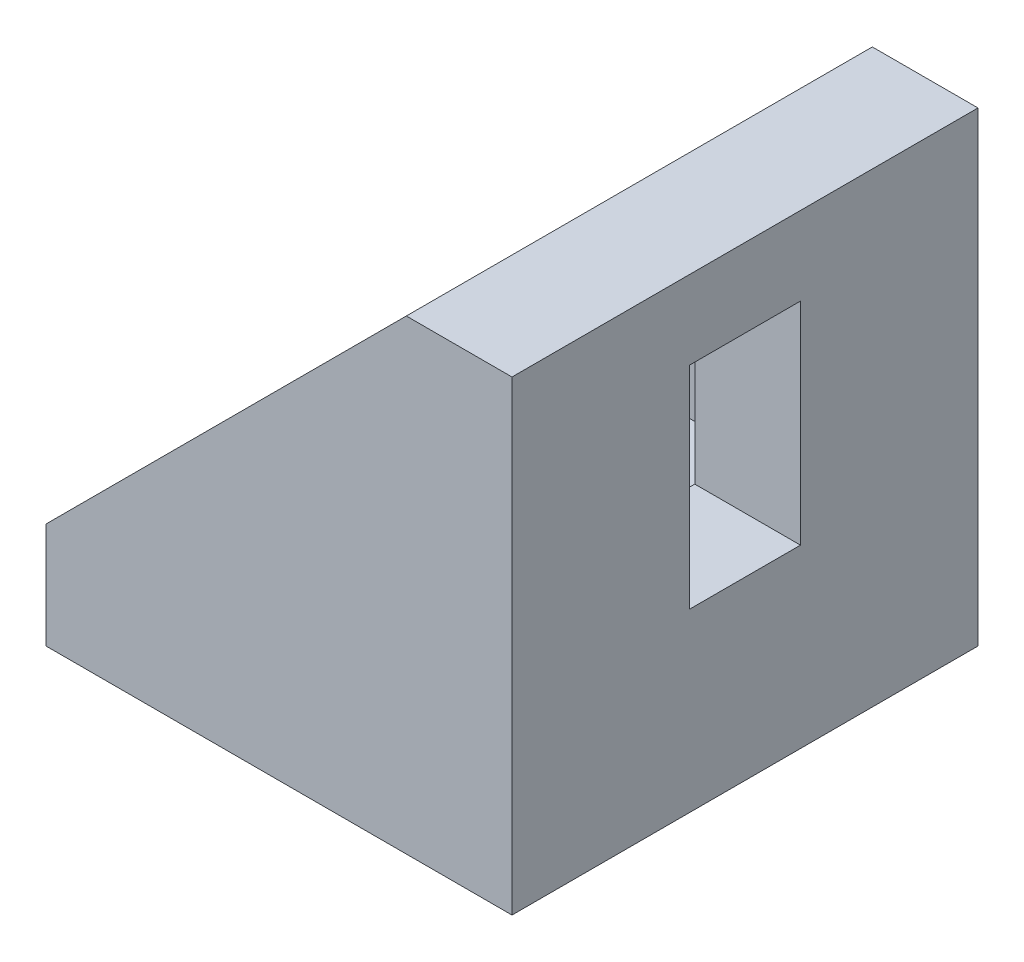
ISO-10303-21;
HEADER;
FILE_DESCRIPTION(('STEP AP214'),'2;1');
FILE_NAME('part.step','',(''),(''),'','','');
FILE_SCHEMA(('AUTOMOTIVE_DESIGN { 1 0 10303 214 1 1 1 1 }'));
ENDSEC;
DATA;
#1=APPLICATION_CONTEXT('core data for automotive mechanical design processes');
#2=APPLICATION_PROTOCOL_DEFINITION('international standard','automotive_design',2000,#1);
#3=PRODUCT_CONTEXT('',#1,'mechanical');
#4=PRODUCT('Part','Part','',(#3));
#5=PRODUCT_RELATED_PRODUCT_CATEGORY('part','',(#4));
#6=PRODUCT_DEFINITION_FORMATION('','',#4);
#7=PRODUCT_DEFINITION_CONTEXT('part definition',#1,'design');
#8=PRODUCT_DEFINITION('design','',#6,#7);
#9=PRODUCT_DEFINITION_SHAPE('','',#8);
#10=(LENGTH_UNIT() NAMED_UNIT(*) SI_UNIT(.MILLI.,.METRE.));
#11=(NAMED_UNIT(*) PLANE_ANGLE_UNIT() SI_UNIT($,.RADIAN.));
#12=(NAMED_UNIT(*) SI_UNIT($,.STERADIAN.) SOLID_ANGLE_UNIT());
#13=UNCERTAINTY_MEASURE_WITH_UNIT(LENGTH_MEASURE(1.E-05),#10,'distance_accuracy_value','');
#14=(GEOMETRIC_REPRESENTATION_CONTEXT(3) GLOBAL_UNCERTAINTY_ASSIGNED_CONTEXT((#13)) GLOBAL_UNIT_ASSIGNED_CONTEXT((#10,
#11,#12)) REPRESENTATION_CONTEXT('',''));
#15=CARTESIAN_POINT('',(0.,0.,0.));
#16=DIRECTION('',(0.,0.,1.));
#17=DIRECTION('',(1.,0.,0.));
#18=AXIS2_PLACEMENT_3D('',#15,#16,#17);
#19=CARTESIAN_POINT('',(0.,42.,21.));
#20=DIRECTION('',(-1.,0.,0.));
#21=DIRECTION('',(0.,0.,1.));
#22=AXIS2_PLACEMENT_3D('',#19,#20,#21);
#23=PLANE('',#22);
#24=DIRECTION('',(0.,0.,-1.));
#25=VECTOR('',#24,1.);
#26=CARTESIAN_POINT('',(0.,0.,21.));
#27=LINE('',#26,#25);
#28=CARTESIAN_POINT('',(0.,0.,21.));
#29=VERTEX_POINT('',#28);
#30=CARTESIAN_POINT('',(0.,0.,-21.));
#31=VERTEX_POINT('',#30);
#32=EDGE_CURVE('E307',#29,#31,#27,.T.);
#33=ORIENTED_EDGE('',*,*,#32,.T.);
#34=DIRECTION('',(0.,1.,0.));
#35=VECTOR('',#34,1.);
#36=CARTESIAN_POINT('',(0.,42.,-21.));
#37=LINE('',#36,#35);
#38=CARTESIAN_POINT('',(0.,42.,-21.));
#39=VERTEX_POINT('',#38);
#40=EDGE_CURVE('E261',#31,#39,#37,.T.);
#41=ORIENTED_EDGE('',*,*,#40,.T.);
#42=DIRECTION('',(0.,0.,-1.));
#43=VECTOR('',#42,1.);
#44=CARTESIAN_POINT('',(0.,42.,21.));
#45=LINE('',#44,#43);
#46=CARTESIAN_POINT('',(0.,42.,21.));
#47=VERTEX_POINT('',#46);
#48=EDGE_CURVE('E11',#47,#39,#45,.T.);
#49=ORIENTED_EDGE('',*,*,#48,.F.);
#50=DIRECTION('',(0.,1.,0.));
#51=VECTOR('',#50,1.);
#52=CARTESIAN_POINT('',(0.,42.,21.));
#53=LINE('',#52,#51);
#54=EDGE_CURVE('E291',#29,#47,#53,.T.);
#55=ORIENTED_EDGE('',*,*,#54,.F.);
#56=EDGE_LOOP('',(#33,#41,#49,#55));
#57=FACE_BOUND('',#56,.T.);
#58=DIRECTION('',(0.,0.,-1.));
#59=VECTOR('',#58,1.);
#60=CARTESIAN_POINT('',(0.,15.875,-5.));
#61=LINE('',#60,#59);
#62=CARTESIAN_POINT('',(0.,15.875,5.));
#63=VERTEX_POINT('',#62);
#64=CARTESIAN_POINT('',(0.,15.875,-5.));
#65=VERTEX_POINT('',#64);
#66=EDGE_CURVE('E160',#63,#65,#61,.T.);
#67=ORIENTED_EDGE('',*,*,#66,.F.);
#68=DIRECTION('',(0.,-1.,0.));
#69=VECTOR('',#68,1.);
#70=CARTESIAN_POINT('',(0.,15.875,5.));
#71=LINE('',#70,#69);
#72=CARTESIAN_POINT('',(0.,34.925,5.));
#73=VERTEX_POINT('',#72);
#74=EDGE_CURVE('E151',#73,#63,#71,.T.);
#75=ORIENTED_EDGE('',*,*,#74,.F.);
#76=DIRECTION('',(0.,0.,1.));
#77=VECTOR('',#76,1.);
#78=CARTESIAN_POINT('',(0.,34.925,-5.));
#79=LINE('',#78,#77);
#80=CARTESIAN_POINT('',(0.,34.925,-5.));
#81=VERTEX_POINT('',#80);
#82=EDGE_CURVE('E159',#81,#73,#79,.T.);
#83=ORIENTED_EDGE('',*,*,#82,.F.);
#84=DIRECTION('',(0.,1.,0.));
#85=VECTOR('',#84,1.);
#86=CARTESIAN_POINT('',(0.,15.875,-5.));
#87=LINE('',#86,#85);
#88=EDGE_CURVE('E165',#65,#81,#87,.T.);
#89=ORIENTED_EDGE('',*,*,#88,.F.);
#90=EDGE_LOOP('',(#67,#75,#83,#89));
#91=FACE_BOUND('',#90,.T.);
#92=ADVANCED_FACE('F39',(#57,#91),#23,.F.);
#93=CARTESIAN_POINT('',(-9.525,9.525,21.));
#94=DIRECTION('',(1.,0.,0.));
#95=DIRECTION('',(0.,1.,0.));
#96=AXIS2_PLACEMENT_3D('',#93,#94,#95);
#97=PLANE('',#96);
#98=DIRECTION('',(0.,0.,-1.));
#99=VECTOR('',#98,1.);
#100=CARTESIAN_POINT('',(-9.525,42.,21.));
#101=LINE('',#100,#99);
#102=CARTESIAN_POINT('',(-9.525,42.,16.2375));
#103=VERTEX_POINT('',#102);
#104=CARTESIAN_POINT('',(-9.525,42.,-16.2375));
#105=VERTEX_POINT('',#104);
#106=EDGE_CURVE('E321',#103,#105,#101,.T.);
#107=ORIENTED_EDGE('',*,*,#106,.T.);
#108=DIRECTION('',(0.,1.,0.));
#109=VECTOR('',#108,1.);
#110=CARTESIAN_POINT('',(-9.525,9.525,-16.2375));
#111=LINE('',#110,#109);
#112=CARTESIAN_POINT('',(-9.525,9.525,-16.2375));
#113=VERTEX_POINT('',#112);
#114=EDGE_CURVE('E241',#113,#105,#111,.T.);
#115=ORIENTED_EDGE('',*,*,#114,.F.);
#116=DIRECTION('',(0.,0.,-1.));
#117=VECTOR('',#116,1.);
#118=CARTESIAN_POINT('',(-9.525,9.525,21.));
#119=LINE('',#118,#117);
#120=CARTESIAN_POINT('',(-9.525,9.525,16.2375));
#121=VERTEX_POINT('',#120);
#122=EDGE_CURVE('E318',#121,#113,#119,.T.);
#123=ORIENTED_EDGE('',*,*,#122,.F.);
#124=DIRECTION('',(0.,1.,0.));
#125=VECTOR('',#124,1.);
#126=CARTESIAN_POINT('',(-9.525,9.525,16.2375));
#127=LINE('',#126,#125);
#128=EDGE_CURVE('E280',#121,#103,#127,.T.);
#129=ORIENTED_EDGE('',*,*,#128,.T.);
#130=EDGE_LOOP('',(#107,#115,#123,#129));
#131=FACE_BOUND('',#130,.T.);
#132=DIRECTION('',(0.,0.,-1.));
#133=VECTOR('',#132,1.);
#134=CARTESIAN_POINT('',(-9.52499999999999,15.875,-5.));
#135=LINE('',#134,#133);
#136=CARTESIAN_POINT('',(-9.525,15.875,5.));
#137=VERTEX_POINT('',#136);
#138=CARTESIAN_POINT('',(-9.52499999999999,15.875,-5.));
#139=VERTEX_POINT('',#138);
#140=EDGE_CURVE('E62',#137,#139,#135,.T.);
#141=ORIENTED_EDGE('',*,*,#140,.T.);
#142=DIRECTION('',(0.,1.,0.));
#143=VECTOR('',#142,1.);
#144=CARTESIAN_POINT('',(-9.52499999999999,15.875,-5.));
#145=LINE('',#144,#143);
#146=CARTESIAN_POINT('',(-9.52499999999999,34.925,-5.));
#147=VERTEX_POINT('',#146);
#148=EDGE_CURVE('E169',#139,#147,#145,.T.);
#149=ORIENTED_EDGE('',*,*,#148,.T.);
#150=DIRECTION('',(0.,0.,1.));
#151=VECTOR('',#150,1.);
#152=CARTESIAN_POINT('',(-9.52499999999999,34.925,-5.));
#153=LINE('',#152,#151);
#154=CARTESIAN_POINT('',(-9.52499999999999,34.925,5.));
#155=VERTEX_POINT('',#154);
#156=EDGE_CURVE('E173',#147,#155,#153,.T.);
#157=ORIENTED_EDGE('',*,*,#156,.T.);
#158=DIRECTION('',(0.,-1.,0.));
#159=VECTOR('',#158,1.);
#160=CARTESIAN_POINT('',(-9.52499999999999,15.875,5.));
#161=LINE('',#160,#159);
#162=EDGE_CURVE('E182',#155,#137,#161,.T.);
#163=ORIENTED_EDGE('',*,*,#162,.T.);
#164=EDGE_LOOP('',(#141,#149,#157,#163));
#165=FACE_BOUND('',#164,.T.);
#166=ADVANCED_FACE('F331',(#131,#165),#97,.F.);
#167=CARTESIAN_POINT('',(-9.525,42.,21.));
#168=DIRECTION('',(0.,-1.,0.));
#169=DIRECTION('',(0.,0.,-1.));
#170=AXIS2_PLACEMENT_3D('',#167,#168,#169);
#171=PLANE('',#170);
#172=ORIENTED_EDGE('',*,*,#48,.T.);
#173=DIRECTION('',(-1.,0.,0.));
#174=VECTOR('',#173,1.);
#175=CARTESIAN_POINT('',(-9.525,42.,-21.));
#176=LINE('',#175,#174);
#177=CARTESIAN_POINT('',(-9.525,42.,-21.));
#178=VERTEX_POINT('',#177);
#179=EDGE_CURVE('E276',#39,#178,#176,.T.);
#180=ORIENTED_EDGE('',*,*,#179,.T.);
#181=DIRECTION('',(0.,0.,-1.));
#182=VECTOR('',#181,1.);
#183=CARTESIAN_POINT('',(-9.525,42.,-16.2375));
#184=LINE('',#183,#182);
#185=EDGE_CURVE('E257',#105,#178,#184,.T.);
#186=ORIENTED_EDGE('',*,*,#185,.F.);
#187=ORIENTED_EDGE('',*,*,#106,.F.);
#188=CARTESIAN_POINT('',(-9.525,42.,21.));
#189=VERTEX_POINT('',#188);
#190=EDGE_CURVE('E47',#189,#103,#101,.T.);
#191=ORIENTED_EDGE('',*,*,#190,.F.);
#192=DIRECTION('',(-1.,0.,0.));
#193=VECTOR('',#192,1.);
#194=CARTESIAN_POINT('',(-9.525,42.,21.));
#195=LINE('',#194,#193);
#196=EDGE_CURVE('E297',#47,#189,#195,.T.);
#197=ORIENTED_EDGE('',*,*,#196,.F.);
#198=EDGE_LOOP('',(#172,#180,#186,#187,#191,#197));
#199=FACE_BOUND('',#198,.T.);
#200=ADVANCED_FACE('F370',(#199),#171,.F.);
#201=CARTESIAN_POINT('',(-42.,9.525,21.));
#202=DIRECTION('',(0.,-1.,0.));
#203=DIRECTION('',(0.,0.,-1.));
#204=AXIS2_PLACEMENT_3D('',#201,#202,#203);
#205=PLANE('',#204);
#206=DIRECTION('',(-1.,0.,0.));
#207=VECTOR('',#206,1.);
#208=CARTESIAN_POINT('',(-15.875,9.525,-5.));
#209=LINE('',#208,#207);
#210=CARTESIAN_POINT('',(-15.875,9.525,-5.));
#211=VERTEX_POINT('',#210);
#212=CARTESIAN_POINT('',(-34.925,9.525,-5.));
#213=VERTEX_POINT('',#212);
#214=EDGE_CURVE('E217',#211,#213,#209,.T.);
#215=ORIENTED_EDGE('',*,*,#214,.F.);
#216=DIRECTION('',(0.,0.,-1.));
#217=VECTOR('',#216,1.);
#218=CARTESIAN_POINT('',(-15.875,9.525,-5.));
#219=LINE('',#218,#217);
#220=CARTESIAN_POINT('',(-15.875,9.525,5.));
#221=VERTEX_POINT('',#220);
#222=EDGE_CURVE('E191',#221,#211,#219,.T.);
#223=ORIENTED_EDGE('',*,*,#222,.F.);
#224=DIRECTION('',(1.,0.,0.));
#225=VECTOR('',#224,1.);
#226=CARTESIAN_POINT('',(-15.875,9.525,5.));
#227=LINE('',#226,#225);
#228=CARTESIAN_POINT('',(-34.925,9.525,5.));
#229=VERTEX_POINT('',#228);
#230=EDGE_CURVE('E202',#229,#221,#227,.T.);
#231=ORIENTED_EDGE('',*,*,#230,.F.);
#232=DIRECTION('',(0.,0.,1.));
#233=VECTOR('',#232,1.);
#234=CARTESIAN_POINT('',(-34.925,9.525,-5.));
#235=LINE('',#234,#233);
#236=EDGE_CURVE('E221',#213,#229,#235,.T.);
#237=ORIENTED_EDGE('',*,*,#236,.F.);
#238=EDGE_LOOP('',(#215,#223,#231,#237));
#239=FACE_BOUND('',#238,.T.);
#240=ORIENTED_EDGE('',*,*,#122,.T.);
#241=DIRECTION('',(1.,0.,0.));
#242=VECTOR('',#241,1.);
#243=CARTESIAN_POINT('',(-42.,9.525,-16.2375));
#244=LINE('',#243,#242);
#245=CARTESIAN_POINT('',(-42.,9.525,-16.2375));
#246=VERTEX_POINT('',#245);
#247=EDGE_CURVE('E245',#246,#113,#244,.T.);
#248=ORIENTED_EDGE('',*,*,#247,.F.);
#249=DIRECTION('',(0.,0.,-1.));
#250=VECTOR('',#249,1.);
#251=CARTESIAN_POINT('',(-42.,9.525,21.));
#252=LINE('',#251,#250);
#253=CARTESIAN_POINT('',(-42.,9.525,16.2375));
#254=VERTEX_POINT('',#253);
#255=EDGE_CURVE('E313',#254,#246,#252,.T.);
#256=ORIENTED_EDGE('',*,*,#255,.F.);
#257=DIRECTION('',(1.,0.,0.));
#258=VECTOR('',#257,1.);
#259=CARTESIAN_POINT('',(-42.,9.525,16.2375));
#260=LINE('',#259,#258);
#261=EDGE_CURVE('E287',#254,#121,#260,.T.);
#262=ORIENTED_EDGE('',*,*,#261,.T.);
#263=EDGE_LOOP('',(#240,#248,#256,#262));
#264=FACE_BOUND('',#263,.T.);
#265=ADVANCED_FACE('F343',(#239,#264),#205,.F.);
#266=CARTESIAN_POINT('',(-42.,0.,21.));
#267=DIRECTION('',(1.,0.,0.));
#268=DIRECTION('',(0.,0.,-1.));
#269=AXIS2_PLACEMENT_3D('',#266,#267,#268);
#270=PLANE('',#269);
#271=ORIENTED_EDGE('',*,*,#255,.T.);
#272=DIRECTION('',(0.,0.,-1.));
#273=VECTOR('',#272,1.);
#274=CARTESIAN_POINT('',(-42.,9.525,-16.2375));
#275=LINE('',#274,#273);
#276=CARTESIAN_POINT('',(-42.,9.525,-21.));
#277=VERTEX_POINT('',#276);
#278=EDGE_CURVE('E253',#246,#277,#275,.T.);
#279=ORIENTED_EDGE('',*,*,#278,.T.);
#280=DIRECTION('',(0.,-1.,0.));
#281=VECTOR('',#280,1.);
#282=CARTESIAN_POINT('',(-42.,0.,-21.));
#283=LINE('',#282,#281);
#284=CARTESIAN_POINT('',(-42.,0.,-21.));
#285=VERTEX_POINT('',#284);
#286=EDGE_CURVE('E272',#277,#285,#283,.T.);
#287=ORIENTED_EDGE('',*,*,#286,.T.);
#288=DIRECTION('',(0.,0.,-1.));
#289=VECTOR('',#288,1.);
#290=CARTESIAN_POINT('',(-42.,0.,21.));
#291=LINE('',#290,#289);
#292=CARTESIAN_POINT('',(-42.,0.,21.));
#293=VERTEX_POINT('',#292);
#294=EDGE_CURVE('E310',#293,#285,#291,.T.);
#295=ORIENTED_EDGE('',*,*,#294,.F.);
#296=DIRECTION('',(0.,-1.,0.));
#297=VECTOR('',#296,1.);
#298=CARTESIAN_POINT('',(-42.,0.,21.));
#299=LINE('',#298,#297);
#300=CARTESIAN_POINT('',(-42.,9.525,21.));
#301=VERTEX_POINT('',#300);
#302=EDGE_CURVE('E301',#301,#293,#299,.T.);
#303=ORIENTED_EDGE('',*,*,#302,.F.);
#304=EDGE_CURVE('E314',#301,#254,#252,.T.);
#305=ORIENTED_EDGE('',*,*,#304,.T.);
#306=EDGE_LOOP('',(#271,#279,#287,#295,#303,#305));
#307=FACE_BOUND('',#306,.T.);
#308=ADVANCED_FACE('F345',(#307),#270,.F.);
#309=CARTESIAN_POINT('',(0.,0.,21.));
#310=DIRECTION('',(0.,1.,0.));
#311=DIRECTION('',(-1.,0.,0.));
#312=AXIS2_PLACEMENT_3D('',#309,#310,#311);
#313=PLANE('',#312);
#314=DIRECTION('',(1.,0.,0.));
#315=VECTOR('',#314,1.);
#316=CARTESIAN_POINT('',(-15.875,0.,5.));
#317=LINE('',#316,#315);
#318=CARTESIAN_POINT('',(-34.925,0.,5.));
#319=VERTEX_POINT('',#318);
#320=CARTESIAN_POINT('',(-15.875,0.,5.));
#321=VERTEX_POINT('',#320);
#322=EDGE_CURVE('E210',#319,#321,#317,.T.);
#323=ORIENTED_EDGE('',*,*,#322,.T.);
#324=DIRECTION('',(0.,0.,-1.));
#325=VECTOR('',#324,1.);
#326=CARTESIAN_POINT('',(-15.875,0.,-5.));
#327=LINE('',#326,#325);
#328=CARTESIAN_POINT('',(-15.875,0.,-5.));
#329=VERTEX_POINT('',#328);
#330=EDGE_CURVE('E197',#321,#329,#327,.T.);
#331=ORIENTED_EDGE('',*,*,#330,.T.);
#332=DIRECTION('',(-1.,0.,0.));
#333=VECTOR('',#332,1.);
#334=CARTESIAN_POINT('',(-15.875,0.,-5.));
#335=LINE('',#334,#333);
#336=CARTESIAN_POINT('',(-34.925,0.,-5.));
#337=VERTEX_POINT('',#336);
#338=EDGE_CURVE('E201',#329,#337,#335,.T.);
#339=ORIENTED_EDGE('',*,*,#338,.T.);
#340=DIRECTION('',(0.,0.,1.));
#341=VECTOR('',#340,1.);
#342=CARTESIAN_POINT('',(-34.925,0.,-5.));
#343=LINE('',#342,#341);
#344=EDGE_CURVE('E206',#337,#319,#343,.T.);
#345=ORIENTED_EDGE('',*,*,#344,.T.);
#346=EDGE_LOOP('',(#323,#331,#339,#345));
#347=FACE_BOUND('',#346,.T.);
#348=ORIENTED_EDGE('',*,*,#294,.T.);
#349=DIRECTION('',(1.,0.,0.));
#350=VECTOR('',#349,1.);
#351=CARTESIAN_POINT('',(0.,0.,-21.));
#352=LINE('',#351,#350);
#353=EDGE_CURVE('E268',#285,#31,#352,.T.);
#354=ORIENTED_EDGE('',*,*,#353,.T.);
#355=ORIENTED_EDGE('',*,*,#32,.F.);
#356=DIRECTION('',(1.,0.,0.));
#357=VECTOR('',#356,1.);
#358=CARTESIAN_POINT('',(0.,0.,21.));
#359=LINE('',#358,#357);
#360=EDGE_CURVE('E304',#293,#29,#359,.T.);
#361=ORIENTED_EDGE('',*,*,#360,.F.);
#362=EDGE_LOOP('',(#348,#354,#355,#361));
#363=FACE_BOUND('',#362,.T.);
#364=ADVANCED_FACE('F381',(#347,#363),#313,.F.);
#365=CARTESIAN_POINT('',(0.,0.,21.));
#366=DIRECTION('',(0.,0.,-1.));
#367=DIRECTION('',(-1.,0.,0.));
#368=AXIS2_PLACEMENT_3D('',#365,#366,#367);
#369=PLANE('',#368);
#370=ORIENTED_EDGE('',*,*,#54,.T.);
#371=ORIENTED_EDGE('',*,*,#196,.T.);
#372=DIRECTION('',(-0.707106781186547,-0.707106781186548,0.));
#373=VECTOR('',#372,1.);
#374=CARTESIAN_POINT('',(-9.525,42.,21.));
#375=LINE('',#374,#373);
#376=EDGE_CURVE('E279',#189,#301,#375,.T.);
#377=ORIENTED_EDGE('',*,*,#376,.T.);
#378=ORIENTED_EDGE('',*,*,#302,.T.);
#379=ORIENTED_EDGE('',*,*,#360,.T.);
#380=EDGE_LOOP('',(#370,#371,#377,#378,#379));
#381=FACE_BOUND('',#380,.T.);
#382=ADVANCED_FACE('F363',(#381),#369,.F.);
#383=CARTESIAN_POINT('',(-9.525,42.,16.2375));
#384=DIRECTION('',(-0.707106781186548,0.707106781186547,0.));
#385=DIRECTION('',(-0.707106781186547,-0.707106781186548,0.));
#386=AXIS2_PLACEMENT_3D('',#383,#384,#385);
#387=PLANE('',#386);
#388=ORIENTED_EDGE('',*,*,#376,.F.);
#389=ORIENTED_EDGE('',*,*,#190,.T.);
#390=DIRECTION('',(-0.707106781186547,-0.707106781186548,0.));
#391=VECTOR('',#390,1.);
#392=CARTESIAN_POINT('',(-9.525,42.,16.2375));
#393=LINE('',#392,#391);
#394=EDGE_CURVE('E284',#103,#254,#393,.T.);
#395=ORIENTED_EDGE('',*,*,#394,.T.);
#396=ORIENTED_EDGE('',*,*,#304,.F.);
#397=EDGE_LOOP('',(#388,#389,#395,#396));
#398=FACE_BOUND('',#397,.T.);
#399=ADVANCED_FACE('F350',(#398),#387,.T.);
#400=CARTESIAN_POINT('',(0.,0.,16.2375));
#401=DIRECTION('',(0.,0.,-1.));
#402=DIRECTION('',(-1.,0.,0.));
#403=AXIS2_PLACEMENT_3D('',#400,#401,#402);
#404=PLANE('',#403);
#405=ORIENTED_EDGE('',*,*,#128,.F.);
#406=ORIENTED_EDGE('',*,*,#261,.F.);
#407=ORIENTED_EDGE('',*,*,#394,.F.);
#408=EDGE_LOOP('',(#405,#406,#407));
#409=FACE_BOUND('',#408,.T.);
#410=ADVANCED_FACE('F353',(#409),#404,.T.);
#411=CARTESIAN_POINT('',(0.,0.,-21.));
#412=DIRECTION('',(0.,0.,1.));
#413=DIRECTION('',(-1.,0.,0.));
#414=AXIS2_PLACEMENT_3D('',#411,#412,#413);
#415=PLANE('',#414);
#416=ORIENTED_EDGE('',*,*,#40,.F.);
#417=ORIENTED_EDGE('',*,*,#353,.F.);
#418=ORIENTED_EDGE('',*,*,#286,.F.);
#419=DIRECTION('',(-0.707106781186547,-0.707106781186548,0.));
#420=VECTOR('',#419,1.);
#421=CARTESIAN_POINT('',(-9.525,42.,-21.));
#422=LINE('',#421,#420);
#423=EDGE_CURVE('E231',#178,#277,#422,.T.);
#424=ORIENTED_EDGE('',*,*,#423,.F.);
#425=ORIENTED_EDGE('',*,*,#179,.F.);
#426=EDGE_LOOP('',(#416,#417,#418,#424,#425));
#427=FACE_BOUND('',#426,.T.);
#428=ADVANCED_FACE('F355',(#427),#415,.F.);
#429=CARTESIAN_POINT('',(-9.525,42.,-16.2375));
#430=DIRECTION('',(0.707106781186548,-0.707106781186547,0.));
#431=DIRECTION('',(0.707106781186547,0.707106781186548,0.));
#432=AXIS2_PLACEMENT_3D('',#429,#430,#431);
#433=PLANE('',#432);
#434=ORIENTED_EDGE('',*,*,#423,.T.);
#435=ORIENTED_EDGE('',*,*,#278,.F.);
#436=DIRECTION('',(-0.707106781186547,-0.707106781186548,0.));
#437=VECTOR('',#436,1.);
#438=CARTESIAN_POINT('',(-9.525,42.,-16.2375));
#439=LINE('',#438,#437);
#440=EDGE_CURVE('E249',#105,#246,#439,.T.);
#441=ORIENTED_EDGE('',*,*,#440,.F.);
#442=ORIENTED_EDGE('',*,*,#185,.T.);
#443=EDGE_LOOP('',(#434,#435,#441,#442));
#444=FACE_BOUND('',#443,.T.);
#445=ADVANCED_FACE('F337',(#444),#433,.F.);
#446=CARTESIAN_POINT('',(0.,0.,-16.2375));
#447=DIRECTION('',(0.,0.,1.));
#448=DIRECTION('',(-1.,0.,0.));
#449=AXIS2_PLACEMENT_3D('',#446,#447,#448);
#450=PLANE('',#449);
#451=ORIENTED_EDGE('',*,*,#114,.T.);
#452=ORIENTED_EDGE('',*,*,#440,.T.);
#453=ORIENTED_EDGE('',*,*,#247,.T.);
#454=EDGE_LOOP('',(#451,#452,#453));
#455=FACE_BOUND('',#454,.T.);
#456=ADVANCED_FACE('F339',(#455),#450,.T.);
#457=CARTESIAN_POINT('',(-15.875,0.,-5.));
#458=DIRECTION('',(1.,0.,0.));
#459=DIRECTION('',(0.,0.,-1.));
#460=AXIS2_PLACEMENT_3D('',#457,#458,#459);
#461=PLANE('',#460);
#462=ORIENTED_EDGE('',*,*,#222,.T.);
#463=DIRECTION('',(0.,1.,0.));
#464=VECTOR('',#463,1.);
#465=CARTESIAN_POINT('',(-15.875,0.,-5.));
#466=LINE('',#465,#464);
#467=EDGE_CURVE('E214',#329,#211,#466,.T.);
#468=ORIENTED_EDGE('',*,*,#467,.F.);
#469=ORIENTED_EDGE('',*,*,#330,.F.);
#470=DIRECTION('',(0.,1.,0.));
#471=VECTOR('',#470,1.);
#472=CARTESIAN_POINT('',(-15.875,0.,5.));
#473=LINE('',#472,#471);
#474=EDGE_CURVE('E228',#321,#221,#473,.T.);
#475=ORIENTED_EDGE('',*,*,#474,.T.);
#476=EDGE_LOOP('',(#462,#468,#469,#475));
#477=FACE_BOUND('',#476,.T.);
#478=ADVANCED_FACE('F446',(#477),#461,.F.);
#479=CARTESIAN_POINT('',(-15.875,0.,5.));
#480=DIRECTION('',(0.,0.,1.));
#481=DIRECTION('',(1.,0.,0.));
#482=AXIS2_PLACEMENT_3D('',#479,#480,#481);
#483=PLANE('',#482);
#484=ORIENTED_EDGE('',*,*,#230,.T.);
#485=ORIENTED_EDGE('',*,*,#474,.F.);
#486=ORIENTED_EDGE('',*,*,#322,.F.);
#487=DIRECTION('',(0.,1.,0.));
#488=VECTOR('',#487,1.);
#489=CARTESIAN_POINT('',(-34.925,0.,5.));
#490=LINE('',#489,#488);
#491=EDGE_CURVE('E232',#319,#229,#490,.T.);
#492=ORIENTED_EDGE('',*,*,#491,.T.);
#493=EDGE_LOOP('',(#484,#485,#486,#492));
#494=FACE_BOUND('',#493,.T.);
#495=ADVANCED_FACE('F465',(#494),#483,.F.);
#496=CARTESIAN_POINT('',(-34.925,0.,-5.));
#497=DIRECTION('',(-1.,0.,0.));
#498=DIRECTION('',(0.,0.,1.));
#499=AXIS2_PLACEMENT_3D('',#496,#497,#498);
#500=PLANE('',#499);
#501=ORIENTED_EDGE('',*,*,#236,.T.);
#502=ORIENTED_EDGE('',*,*,#491,.F.);
#503=ORIENTED_EDGE('',*,*,#344,.F.);
#504=DIRECTION('',(0.,1.,0.));
#505=VECTOR('',#504,1.);
#506=CARTESIAN_POINT('',(-34.925,0.,-5.));
#507=LINE('',#506,#505);
#508=EDGE_CURVE('E235',#337,#213,#507,.T.);
#509=ORIENTED_EDGE('',*,*,#508,.T.);
#510=EDGE_LOOP('',(#501,#502,#503,#509));
#511=FACE_BOUND('',#510,.T.);
#512=ADVANCED_FACE('F475',(#511),#500,.F.);
#513=CARTESIAN_POINT('',(-15.875,0.,-5.));
#514=DIRECTION('',(0.,0.,-1.));
#515=DIRECTION('',(-1.,0.,0.));
#516=AXIS2_PLACEMENT_3D('',#513,#514,#515);
#517=PLANE('',#516);
#518=ORIENTED_EDGE('',*,*,#214,.T.);
#519=ORIENTED_EDGE('',*,*,#508,.F.);
#520=ORIENTED_EDGE('',*,*,#338,.F.);
#521=ORIENTED_EDGE('',*,*,#467,.T.);
#522=EDGE_LOOP('',(#518,#519,#520,#521));
#523=FACE_BOUND('',#522,.T.);
#524=ADVANCED_FACE('F485',(#523),#517,.F.);
#525=CARTESIAN_POINT('',(0.,15.875,-5.));
#526=DIRECTION('',(0.,1.,0.));
#527=DIRECTION('',(-1.,0.,0.));
#528=AXIS2_PLACEMENT_3D('',#525,#526,#527);
#529=PLANE('',#528);
#530=ORIENTED_EDGE('',*,*,#140,.F.);
#531=DIRECTION('',(-1.,0.,0.));
#532=VECTOR('',#531,1.);
#533=CARTESIAN_POINT('',(0.,15.875,5.));
#534=LINE('',#533,#532);
#535=EDGE_CURVE('E153',#63,#137,#534,.T.);
#536=ORIENTED_EDGE('',*,*,#535,.F.);
#537=ORIENTED_EDGE('',*,*,#66,.T.);
#538=DIRECTION('',(-1.,0.,0.));
#539=VECTOR('',#538,1.);
#540=CARTESIAN_POINT('',(0.,15.875,-5.));
#541=LINE('',#540,#539);
#542=EDGE_CURVE('E188',#65,#139,#541,.T.);
#543=ORIENTED_EDGE('',*,*,#542,.T.);
#544=EDGE_LOOP('',(#530,#536,#537,#543));
#545=FACE_BOUND('',#544,.T.);
#546=ADVANCED_FACE('F162',(#545),#529,.T.);
#547=CARTESIAN_POINT('',(0.,15.875,-5.));
#548=DIRECTION('',(0.,0.,1.));
#549=DIRECTION('',(0.,-1.,0.));
#550=AXIS2_PLACEMENT_3D('',#547,#548,#549);
#551=PLANE('',#550);
#552=ORIENTED_EDGE('',*,*,#148,.F.);
#553=ORIENTED_EDGE('',*,*,#542,.F.);
#554=ORIENTED_EDGE('',*,*,#88,.T.);
#555=DIRECTION('',(-1.,0.,0.));
#556=VECTOR('',#555,1.);
#557=CARTESIAN_POINT('',(0.,34.925,-5.));
#558=LINE('',#557,#556);
#559=EDGE_CURVE('E192',#81,#147,#558,.T.);
#560=ORIENTED_EDGE('',*,*,#559,.T.);
#561=EDGE_LOOP('',(#552,#553,#554,#560));
#562=FACE_BOUND('',#561,.T.);
#563=ADVANCED_FACE('F516',(#562),#551,.T.);
#564=CARTESIAN_POINT('',(0.,34.925,-5.));
#565=DIRECTION('',(0.,-1.,0.));
#566=DIRECTION('',(1.,0.,0.));
#567=AXIS2_PLACEMENT_3D('',#564,#565,#566);
#568=PLANE('',#567);
#569=ORIENTED_EDGE('',*,*,#156,.F.);
#570=ORIENTED_EDGE('',*,*,#559,.F.);
#571=ORIENTED_EDGE('',*,*,#82,.T.);
#572=DIRECTION('',(-1.,0.,0.));
#573=VECTOR('',#572,1.);
#574=CARTESIAN_POINT('',(0.,34.925,5.));
#575=LINE('',#574,#573);
#576=EDGE_CURVE('E54',#73,#155,#575,.T.);
#577=ORIENTED_EDGE('',*,*,#576,.T.);
#578=EDGE_LOOP('',(#569,#570,#571,#577));
#579=FACE_BOUND('',#578,.T.);
#580=ADVANCED_FACE('F525',(#579),#568,.T.);
#581=CARTESIAN_POINT('',(0.,15.875,5.));
#582=DIRECTION('',(0.,0.,-1.));
#583=DIRECTION('',(0.,1.,0.));
#584=AXIS2_PLACEMENT_3D('',#581,#582,#583);
#585=PLANE('',#584);
#586=ORIENTED_EDGE('',*,*,#162,.F.);
#587=ORIENTED_EDGE('',*,*,#576,.F.);
#588=ORIENTED_EDGE('',*,*,#74,.T.);
#589=ORIENTED_EDGE('',*,*,#535,.T.);
#590=EDGE_LOOP('',(#586,#587,#588,#589));
#591=FACE_BOUND('',#590,.T.);
#592=ADVANCED_FACE('F152',(#591),#585,.T.);
#593=CLOSED_SHELL('',(#92,#166,#200,#265,#308,#364,#382,#399,#410,#428,#445,#456,#478,#495,#512,
#524,#546,#563,#580,#592));
#594=MANIFOLD_SOLID_BREP('B2',#593);
#595=ADVANCED_BREP_SHAPE_REPRESENTATION('',(#18,#594),#14);
#596=SHAPE_DEFINITION_REPRESENTATION(#9,#595);
ENDSEC;
END-ISO-10303-21;
